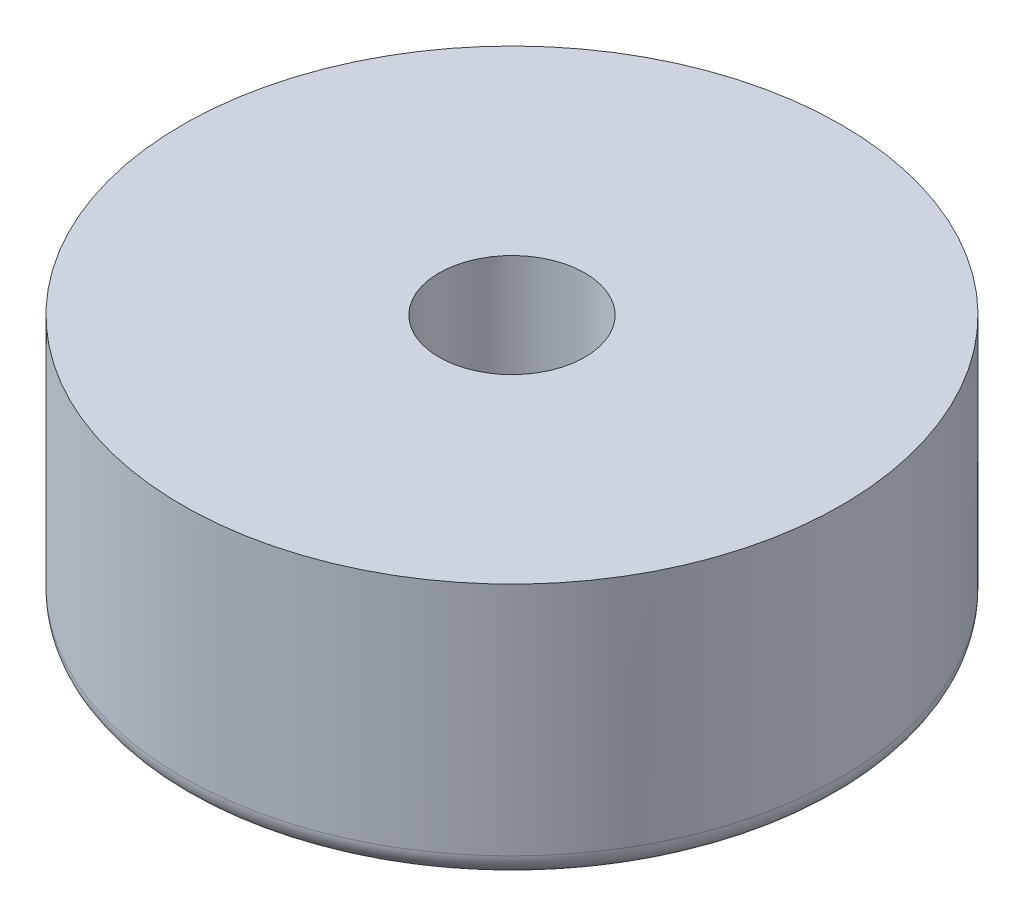
ISO-10303-21;
HEADER;
FILE_DESCRIPTION(('STEP AP214'),'2;1');
FILE_NAME('part.step','',(''),(''),'','','');
FILE_SCHEMA(('AUTOMOTIVE_DESIGN { 1 0 10303 214 1 1 1 1 }'));
ENDSEC;
DATA;
#1=APPLICATION_CONTEXT('core data for automotive mechanical design processes');
#2=APPLICATION_PROTOCOL_DEFINITION('international standard','automotive_design',2000,#1);
#3=PRODUCT_CONTEXT('',#1,'mechanical');
#4=PRODUCT('Part','Part','',(#3));
#5=PRODUCT_RELATED_PRODUCT_CATEGORY('part','',(#4));
#6=PRODUCT_DEFINITION_FORMATION('','',#4);
#7=PRODUCT_DEFINITION_CONTEXT('part definition',#1,'design');
#8=PRODUCT_DEFINITION('design','',#6,#7);
#9=PRODUCT_DEFINITION_SHAPE('','',#8);
#10=(LENGTH_UNIT() NAMED_UNIT(*) SI_UNIT(.MILLI.,.METRE.));
#11=(NAMED_UNIT(*) PLANE_ANGLE_UNIT() SI_UNIT($,.RADIAN.));
#12=(NAMED_UNIT(*) SI_UNIT($,.STERADIAN.) SOLID_ANGLE_UNIT());
#13=UNCERTAINTY_MEASURE_WITH_UNIT(LENGTH_MEASURE(1.E-05),#10,'distance_accuracy_value','');
#14=(GEOMETRIC_REPRESENTATION_CONTEXT(3) GLOBAL_UNCERTAINTY_ASSIGNED_CONTEXT((#13)) GLOBAL_UNIT_ASSIGNED_CONTEXT((#10,
#11,#12)) REPRESENTATION_CONTEXT('',''));
#15=CARTESIAN_POINT('',(0.,0.,0.));
#16=DIRECTION('',(0.,0.,1.));
#17=DIRECTION('',(1.,0.,0.));
#18=AXIS2_PLACEMENT_3D('',#15,#16,#17);
#19=CARTESIAN_POINT('',(0.,0.,0.));
#20=DIRECTION('',(0.,-1.,0.));
#21=DIRECTION('',(0.,0.,-1.));
#22=AXIS2_PLACEMENT_3D('',#19,#20,#21);
#23=CYLINDRICAL_SURFACE('',#22,1.55);
#24=CARTESIAN_POINT('',(0.,0.,0.));
#25=DIRECTION('',(0.,-1.,0.));
#26=DIRECTION('',(0.,0.,-1.));
#27=AXIS2_PLACEMENT_3D('',#24,#25,#26);
#28=CIRCLE('',#27,1.55);
#29=CARTESIAN_POINT('',(0.,0.,-1.55));
#30=VERTEX_POINT('',#29);
#31=EDGE_CURVE('E53',#30,#30,#28,.T.);
#32=ORIENTED_EDGE('',*,*,#31,.F.);
#33=EDGE_LOOP('',(#32));
#34=FACE_BOUND('',#33,.T.);
#35=CARTESIAN_POINT('',(0.,-3.37383177570093,0.));
#36=DIRECTION('',(0.,-1.,0.));
#37=DIRECTION('',(0.,0.,-1.));
#38=AXIS2_PLACEMENT_3D('',#35,#36,#37);
#39=CIRCLE('',#38,1.55);
#40=CARTESIAN_POINT('',(0.,-3.37383177570093,-1.55));
#41=VERTEX_POINT('',#40);
#42=EDGE_CURVE('E62',#41,#41,#39,.T.);
#43=ORIENTED_EDGE('',*,*,#42,.T.);
#44=EDGE_LOOP('',(#43));
#45=FACE_BOUND('',#44,.T.);
#46=ADVANCED_FACE('F33',(#34,#45),#23,.F.);
#47=CARTESIAN_POINT('',(-1.55,0.,0.));
#48=DIRECTION('',(0.,-1.,0.));
#49=DIRECTION('',(0.,0.,-1.));
#50=AXIS2_PLACEMENT_3D('',#47,#48,#49);
#51=PLANE('',#50);
#52=CARTESIAN_POINT('',(0.,0.,0.));
#53=DIRECTION('',(0.,-1.,0.));
#54=DIRECTION('',(0.,0.,-1.));
#55=AXIS2_PLACEMENT_3D('',#52,#53,#54);
#56=CIRCLE('',#55,7.);
#57=CARTESIAN_POINT('',(0.,0.,-7.));
#58=VERTEX_POINT('',#57);
#59=EDGE_CURVE('E56',#58,#58,#56,.T.);
#60=ORIENTED_EDGE('',*,*,#59,.F.);
#61=EDGE_LOOP('',(#60));
#62=FACE_BOUND('',#61,.T.);
#63=ORIENTED_EDGE('',*,*,#31,.T.);
#64=EDGE_LOOP('',(#63));
#65=FACE_BOUND('',#64,.T.);
#66=ADVANCED_FACE('F85',(#62,#65),#51,.F.);
#67=CARTESIAN_POINT('',(0.,0.,0.));
#68=DIRECTION('',(0.,-1.,0.));
#69=DIRECTION('',(0.,0.,-1.));
#70=AXIS2_PLACEMENT_3D('',#67,#68,#69);
#71=CYLINDRICAL_SURFACE('',#70,7.);
#72=CARTESIAN_POINT('',(0.,-5.,0.));
#73=DIRECTION('',(0.,1.,0.));
#74=DIRECTION('',(0.,0.,1.));
#75=AXIS2_PLACEMENT_3D('',#72,#73,#74);
#76=CIRCLE('',#75,7.);
#77=CARTESIAN_POINT('',(0.,-5.,7.));
#78=VERTEX_POINT('',#77);
#79=EDGE_CURVE('E40',#78,#78,#76,.T.);
#80=ORIENTED_EDGE('',*,*,#79,.T.);
#81=EDGE_LOOP('',(#80));
#82=FACE_BOUND('',#81,.T.);
#83=ORIENTED_EDGE('',*,*,#59,.T.);
#84=EDGE_LOOP('',(#83));
#85=FACE_BOUND('',#84,.T.);
#86=ADVANCED_FACE('F81',(#82,#85),#71,.T.);
#87=CARTESIAN_POINT('',(-7.,-5.5,0.));
#88=DIRECTION('',(0.,1.,0.));
#89=DIRECTION('',(0.,0.,1.));
#90=AXIS2_PLACEMENT_3D('',#87,#88,#89);
#91=PLANE('',#90);
#92=CARTESIAN_POINT('',(0.,-5.5,0.));
#93=DIRECTION('',(0.,1.,0.));
#94=DIRECTION('',(0.,0.,1.));
#95=AXIS2_PLACEMENT_3D('',#92,#93,#94);
#96=CIRCLE('',#95,6.5);
#97=CARTESIAN_POINT('',(0.,-5.5,6.5));
#98=VERTEX_POINT('',#97);
#99=EDGE_CURVE('E44',#98,#98,#96,.F.);
#100=ORIENTED_EDGE('',*,*,#99,.T.);
#101=EDGE_LOOP('',(#100));
#102=FACE_BOUND('',#101,.T.);
#103=CARTESIAN_POINT('',(0.,-5.5,0.));
#104=DIRECTION('',(0.,1.,0.));
#105=DIRECTION('',(0.,0.,1.));
#106=AXIS2_PLACEMENT_3D('',#103,#104,#105);
#107=CIRCLE('',#106,4.5);
#108=CARTESIAN_POINT('',(0.,-5.5,4.5));
#109=VERTEX_POINT('',#108);
#110=EDGE_CURVE('E48',#109,#109,#107,.T.);
#111=ORIENTED_EDGE('',*,*,#110,.T.);
#112=EDGE_LOOP('',(#111));
#113=FACE_BOUND('',#112,.T.);
#114=ADVANCED_FACE('F76',(#102,#113),#91,.F.);
#115=CARTESIAN_POINT('',(0.,0.,0.));
#116=DIRECTION('',(0.,-1.,0.));
#117=DIRECTION('',(0.,0.,-1.));
#118=AXIS2_PLACEMENT_3D('',#115,#116,#117);
#119=CYLINDRICAL_SURFACE('',#118,4.);
#120=CARTESIAN_POINT('',(0.,-5.,0.));
#121=DIRECTION('',(0.,1.,0.));
#122=DIRECTION('',(0.,0.,1.));
#123=AXIS2_PLACEMENT_3D('',#120,#121,#122);
#124=CIRCLE('',#123,4.);
#125=CARTESIAN_POINT('',(0.,-5.,4.));
#126=VERTEX_POINT('',#125);
#127=EDGE_CURVE('E10',#126,#126,#124,.F.);
#128=ORIENTED_EDGE('',*,*,#127,.T.);
#129=EDGE_LOOP('',(#128));
#130=FACE_BOUND('',#129,.T.);
#131=CARTESIAN_POINT('',(0.,-3.37383177570093,0.));
#132=DIRECTION('',(0.,-1.,0.));
#133=DIRECTION('',(0.,0.,-1.));
#134=AXIS2_PLACEMENT_3D('',#131,#132,#133);
#135=CIRCLE('',#134,4.);
#136=CARTESIAN_POINT('',(0.,-3.37383177570093,-4.));
#137=VERTEX_POINT('',#136);
#138=EDGE_CURVE('E59',#137,#137,#135,.T.);
#139=ORIENTED_EDGE('',*,*,#138,.F.);
#140=EDGE_LOOP('',(#139));
#141=FACE_BOUND('',#140,.T.);
#142=ADVANCED_FACE('F71',(#130,#141),#119,.F.);
#143=CARTESIAN_POINT('',(-4.,-3.37383177570093,0.));
#144=DIRECTION('',(0.,1.,0.));
#145=DIRECTION('',(0.,0.,1.));
#146=AXIS2_PLACEMENT_3D('',#143,#144,#145);
#147=PLANE('',#146);
#148=ORIENTED_EDGE('',*,*,#42,.F.);
#149=EDGE_LOOP('',(#148));
#150=FACE_BOUND('',#149,.T.);
#151=ORIENTED_EDGE('',*,*,#138,.T.);
#152=EDGE_LOOP('',(#151));
#153=FACE_BOUND('',#152,.T.);
#154=ADVANCED_FACE('F67',(#150,#153),#147,.F.);
#155=CARTESIAN_POINT('',(0.,-5.,0.));
#156=DIRECTION('',(0.,1.,0.));
#157=DIRECTION('',(0.,0.,1.));
#158=AXIS2_PLACEMENT_3D('',#155,#156,#157);
#159=TOROIDAL_SURFACE('',#158,6.5,0.5);
#160=ORIENTED_EDGE('',*,*,#79,.F.);
#161=EDGE_LOOP('',(#160));
#162=FACE_BOUND('',#161,.T.);
#163=ORIENTED_EDGE('',*,*,#99,.F.);
#164=EDGE_LOOP('',(#163));
#165=FACE_BOUND('',#164,.T.);
#166=ADVANCED_FACE('F70',(#162,#165),#159,.T.);
#167=CARTESIAN_POINT('',(0.,-5.,0.));
#168=DIRECTION('',(0.,1.,0.));
#169=DIRECTION('',(0.,0.,1.));
#170=AXIS2_PLACEMENT_3D('',#167,#168,#169);
#171=TOROIDAL_SURFACE('',#170,4.5,0.5);
#172=ORIENTED_EDGE('',*,*,#110,.F.);
#173=EDGE_LOOP('',(#172));
#174=FACE_BOUND('',#173,.T.);
#175=ORIENTED_EDGE('',*,*,#127,.F.);
#176=EDGE_LOOP('',(#175));
#177=FACE_BOUND('',#176,.T.);
#178=ADVANCED_FACE('F35',(#174,#177),#171,.T.);
#179=CLOSED_SHELL('',(#46,#66,#86,#114,#142,#154,#166,#178));
#180=MANIFOLD_SOLID_BREP('B2',#179);
#181=ADVANCED_BREP_SHAPE_REPRESENTATION('',(#18,#180),#14);
#182=SHAPE_DEFINITION_REPRESENTATION(#9,#181);
ENDSEC;
END-ISO-10303-21;
